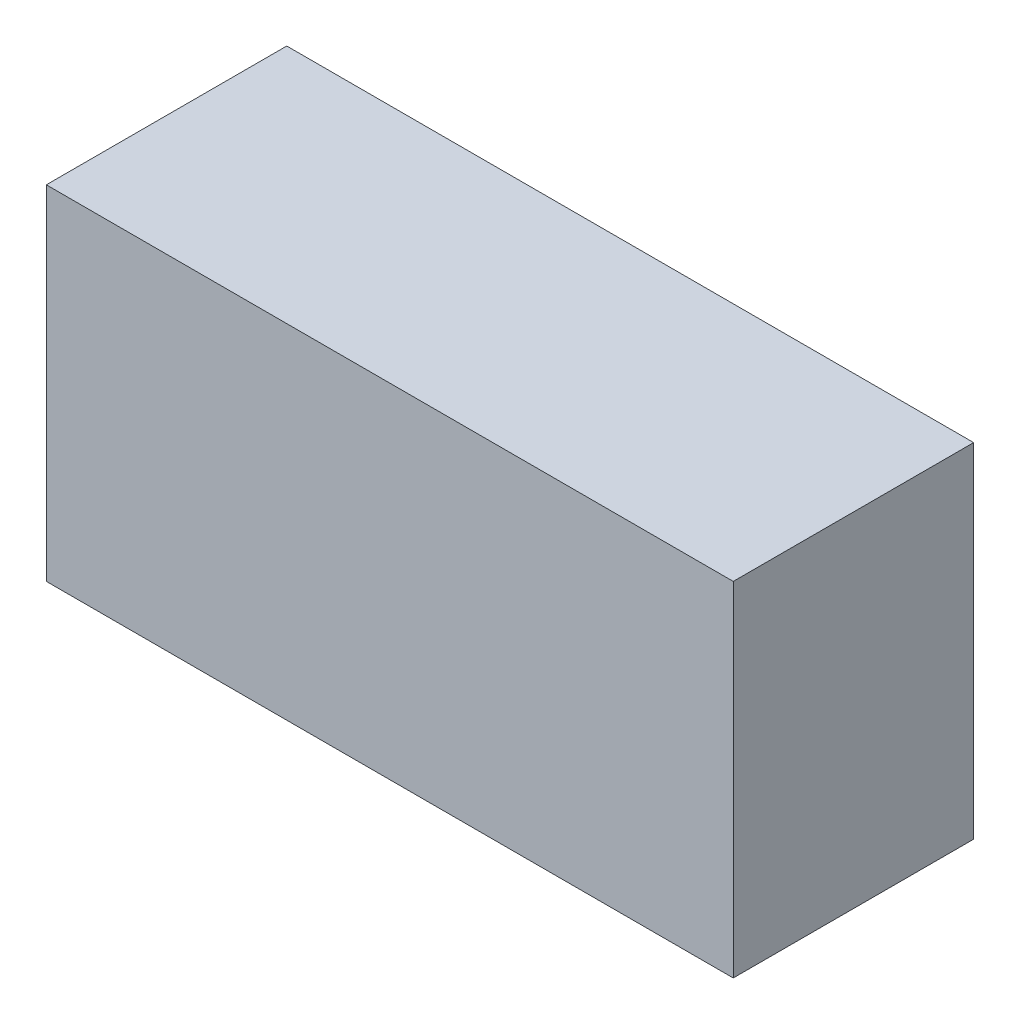
ISO-10303-21;
HEADER;
FILE_DESCRIPTION(('STEP AP214'),'2;1');
FILE_NAME('part.step','',(''),(''),'','','');
FILE_SCHEMA(('AUTOMOTIVE_DESIGN { 1 0 10303 214 1 1 1 1 }'));
ENDSEC;
DATA;
#1=APPLICATION_CONTEXT('core data for automotive mechanical design processes');
#2=APPLICATION_PROTOCOL_DEFINITION('international standard','automotive_design',2000,#1);
#3=PRODUCT_CONTEXT('',#1,'mechanical');
#4=PRODUCT('Part','Part','',(#3));
#5=PRODUCT_RELATED_PRODUCT_CATEGORY('part','',(#4));
#6=PRODUCT_DEFINITION_FORMATION('','',#4);
#7=PRODUCT_DEFINITION_CONTEXT('part definition',#1,'design');
#8=PRODUCT_DEFINITION('design','',#6,#7);
#9=PRODUCT_DEFINITION_SHAPE('','',#8);
#10=(LENGTH_UNIT() NAMED_UNIT(*) SI_UNIT(.MILLI.,.METRE.));
#11=(NAMED_UNIT(*) PLANE_ANGLE_UNIT() SI_UNIT($,.RADIAN.));
#12=(NAMED_UNIT(*) SI_UNIT($,.STERADIAN.) SOLID_ANGLE_UNIT());
#13=UNCERTAINTY_MEASURE_WITH_UNIT(LENGTH_MEASURE(1.E-05),#10,'distance_accuracy_value','');
#14=(GEOMETRIC_REPRESENTATION_CONTEXT(3) GLOBAL_UNCERTAINTY_ASSIGNED_CONTEXT((#13)) GLOBAL_UNIT_ASSIGNED_CONTEXT((#10,
#11,#12)) REPRESENTATION_CONTEXT('',''));
#15=CARTESIAN_POINT('',(0.,0.,0.));
#16=DIRECTION('',(0.,0.,1.));
#17=DIRECTION('',(1.,0.,0.));
#18=AXIS2_PLACEMENT_3D('',#15,#16,#17);
#19=CARTESIAN_POINT('',(0.50000408,-0.2499995,0.3499993));
#20=DIRECTION('',(0.,0.,1.));
#21=DIRECTION('',(1.,0.,0.));
#22=AXIS2_PLACEMENT_3D('',#19,#20,#21);
#23=PLANE('',#22);
#24=DIRECTION('',(0.,1.,0.));
#25=VECTOR('',#24,1.);
#26=CARTESIAN_POINT('',(-0.50000154,0.2499995,0.3499993));
#27=LINE('',#26,#25);
#28=CARTESIAN_POINT('',(-0.50000154,0.2499995,0.3499993));
#29=VERTEX_POINT('',#28);
#30=CARTESIAN_POINT('',(-0.50000154,-0.2499995,0.3499993));
#31=VERTEX_POINT('',#30);
#32=EDGE_CURVE('E68',#29,#31,#27,.F.);
#33=ORIENTED_EDGE('',*,*,#32,.T.);
#34=DIRECTION('',(1.,0.,0.));
#35=VECTOR('',#34,1.);
#36=CARTESIAN_POINT('',(0.50000408,-0.2499995,0.3499993));
#37=LINE('',#36,#35);
#38=CARTESIAN_POINT('',(0.49999646,-0.2499995,0.3499993));
#39=VERTEX_POINT('',#38);
#40=EDGE_CURVE('E64',#31,#39,#37,.T.);
#41=ORIENTED_EDGE('',*,*,#40,.T.);
#42=DIRECTION('',(0.,1.,0.));
#43=VECTOR('',#42,1.);
#44=CARTESIAN_POINT('',(0.49999646,-0.2499995,0.3499993));
#45=LINE('',#44,#43);
#46=CARTESIAN_POINT('',(0.49999646,0.2499995,0.3499993));
#47=VERTEX_POINT('',#46);
#48=EDGE_CURVE('E19',#39,#47,#45,.T.);
#49=ORIENTED_EDGE('',*,*,#48,.T.);
#50=DIRECTION('',(1.,0.,0.));
#51=VECTOR('',#50,1.);
#52=CARTESIAN_POINT('',(0.49999646,0.2499995,0.3499993));
#53=LINE('',#52,#51);
#54=EDGE_CURVE('E75',#47,#29,#53,.F.);
#55=ORIENTED_EDGE('',*,*,#54,.T.);
#56=EDGE_LOOP('',(#33,#41,#49,#55));
#57=FACE_BOUND('',#56,.T.);
#58=ADVANCED_FACE('F16',(#57),#23,.T.);
#59=CARTESIAN_POINT('',(0.49999646,-0.24999442,0.));
#60=DIRECTION('',(-1.,0.,0.));
#61=DIRECTION('',(0.,0.,1.));
#62=AXIS2_PLACEMENT_3D('',#59,#60,#61);
#63=PLANE('',#62);
#64=DIRECTION('',(0.,0.,-1.));
#65=VECTOR('',#64,1.);
#66=CARTESIAN_POINT('',(0.49999646,0.2499995,0.));
#67=LINE('',#66,#65);
#68=CARTESIAN_POINT('',(0.49999646,0.2499995,0.));
#69=VERTEX_POINT('',#68);
#70=EDGE_CURVE('E58',#69,#47,#67,.F.);
#71=ORIENTED_EDGE('',*,*,#70,.T.);
#72=ORIENTED_EDGE('',*,*,#48,.F.);
#73=DIRECTION('',(0.,0.,-1.));
#74=VECTOR('',#73,1.);
#75=CARTESIAN_POINT('',(0.49999646,-0.2499995,0.));
#76=LINE('',#75,#74);
#77=CARTESIAN_POINT('',(0.49999646,-0.2499995,0.));
#78=VERTEX_POINT('',#77);
#79=EDGE_CURVE('E57',#39,#78,#76,.T.);
#80=ORIENTED_EDGE('',*,*,#79,.T.);
#81=DIRECTION('',(0.,1.,0.));
#82=VECTOR('',#81,1.);
#83=CARTESIAN_POINT('',(0.49999646,-0.24999442,0.));
#84=LINE('',#83,#82);
#85=EDGE_CURVE('E65',#78,#69,#84,.T.);
#86=ORIENTED_EDGE('',*,*,#85,.T.);
#87=EDGE_LOOP('',(#71,#72,#80,#86));
#88=FACE_BOUND('',#87,.T.);
#89=ADVANCED_FACE('F55',(#88),#63,.F.);
#90=CARTESIAN_POINT('',(0.49999646,0.2499995,0.));
#91=DIRECTION('',(0.,-1.,0.));
#92=DIRECTION('',(0.,0.,-1.));
#93=AXIS2_PLACEMENT_3D('',#90,#91,#92);
#94=PLANE('',#93);
#95=DIRECTION('',(0.,0.,-1.));
#96=VECTOR('',#95,1.);
#97=CARTESIAN_POINT('',(-0.50000154,0.2499995,0.));
#98=LINE('',#97,#96);
#99=CARTESIAN_POINT('',(-0.50000154,0.2499995,0.));
#100=VERTEX_POINT('',#99);
#101=EDGE_CURVE('E77',#100,#29,#98,.F.);
#102=ORIENTED_EDGE('',*,*,#101,.T.);
#103=ORIENTED_EDGE('',*,*,#54,.F.);
#104=ORIENTED_EDGE('',*,*,#70,.F.);
#105=DIRECTION('',(1.,0.,0.));
#106=VECTOR('',#105,1.);
#107=CARTESIAN_POINT('',(0.50000408,0.2499995,0.));
#108=LINE('',#107,#106);
#109=EDGE_CURVE('E71',#69,#100,#108,.F.);
#110=ORIENTED_EDGE('',*,*,#109,.T.);
#111=EDGE_LOOP('',(#102,#103,#104,#110));
#112=FACE_BOUND('',#111,.T.);
#113=ADVANCED_FACE('F100',(#112),#94,.F.);
#114=CARTESIAN_POINT('',(-0.50000154,0.2499995,0.));
#115=DIRECTION('',(1.,0.,0.));
#116=DIRECTION('',(0.,0.,-1.));
#117=AXIS2_PLACEMENT_3D('',#114,#115,#116);
#118=PLANE('',#117);
#119=DIRECTION('',(0.,0.,1.));
#120=VECTOR('',#119,1.);
#121=CARTESIAN_POINT('',(-0.50000154,-0.2499995,0.));
#122=LINE('',#121,#120);
#123=CARTESIAN_POINT('',(-0.50000154,-0.2499995,0.));
#124=VERTEX_POINT('',#123);
#125=EDGE_CURVE('E33',#124,#31,#122,.T.);
#126=ORIENTED_EDGE('',*,*,#125,.T.);
#127=ORIENTED_EDGE('',*,*,#32,.F.);
#128=ORIENTED_EDGE('',*,*,#101,.F.);
#129=DIRECTION('',(0.,1.,0.));
#130=VECTOR('',#129,1.);
#131=CARTESIAN_POINT('',(-0.50000154,-0.2499995,0.));
#132=LINE('',#131,#130);
#133=EDGE_CURVE('E25',#100,#124,#132,.F.);
#134=ORIENTED_EDGE('',*,*,#133,.T.);
#135=EDGE_LOOP('',(#126,#127,#128,#134));
#136=FACE_BOUND('',#135,.T.);
#137=ADVANCED_FACE('F95',(#136),#118,.F.);
#138=CARTESIAN_POINT('',(-0.50000154,-0.2499995,0.));
#139=DIRECTION('',(0.,1.,0.));
#140=DIRECTION('',(0.,0.,1.));
#141=AXIS2_PLACEMENT_3D('',#138,#139,#140);
#142=PLANE('',#141);
#143=ORIENTED_EDGE('',*,*,#79,.F.);
#144=ORIENTED_EDGE('',*,*,#40,.F.);
#145=ORIENTED_EDGE('',*,*,#125,.F.);
#146=DIRECTION('',(1.,0.,0.));
#147=VECTOR('',#146,1.);
#148=CARTESIAN_POINT('',(-0.50000154,-0.2499995,0.));
#149=LINE('',#148,#147);
#150=EDGE_CURVE('E11',#124,#78,#149,.T.);
#151=ORIENTED_EDGE('',*,*,#150,.T.);
#152=EDGE_LOOP('',(#143,#144,#145,#151));
#153=FACE_BOUND('',#152,.T.);
#154=ADVANCED_FACE('F63',(#153),#142,.F.);
#155=CARTESIAN_POINT('',(0.50000408,-0.2499995,0.));
#156=DIRECTION('',(0.,0.,1.));
#157=DIRECTION('',(1.,0.,0.));
#158=AXIS2_PLACEMENT_3D('',#155,#156,#157);
#159=PLANE('',#158);
#160=ORIENTED_EDGE('',*,*,#133,.F.);
#161=ORIENTED_EDGE('',*,*,#109,.F.);
#162=ORIENTED_EDGE('',*,*,#85,.F.);
#163=ORIENTED_EDGE('',*,*,#150,.F.);
#164=EDGE_LOOP('',(#160,#161,#162,#163));
#165=FACE_BOUND('',#164,.T.);
#166=ADVANCED_FACE('F98',(#165),#159,.F.);
#167=CLOSED_SHELL('',(#58,#89,#113,#137,#154,#166));
#168=MANIFOLD_SOLID_BREP('B1',#167);
#169=ADVANCED_BREP_SHAPE_REPRESENTATION('',(#18,#168),#14);
#170=SHAPE_DEFINITION_REPRESENTATION(#9,#169);
ENDSEC;
END-ISO-10303-21;
